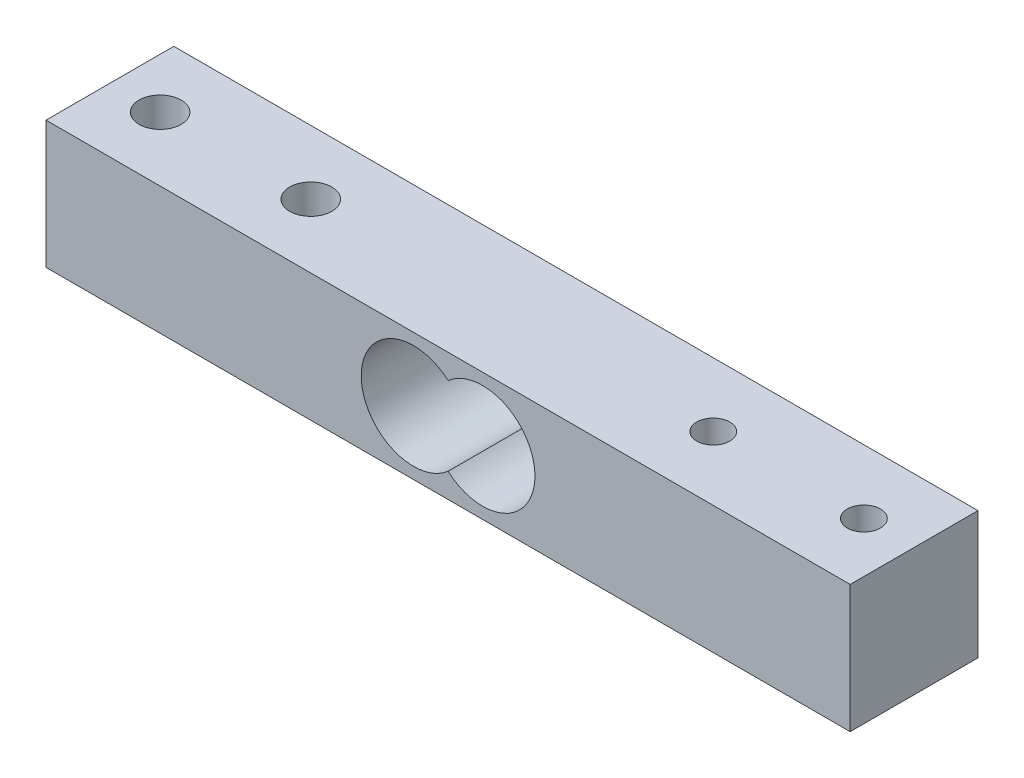
ISO-10303-21;
HEADER;
FILE_DESCRIPTION(('STEP AP214'),'2;1');
FILE_NAME('part.step','',(''),(''),'','','');
FILE_SCHEMA(('AUTOMOTIVE_DESIGN { 1 0 10303 214 1 1 1 1 }'));
ENDSEC;
DATA;
#1=APPLICATION_CONTEXT('core data for automotive mechanical design processes');
#2=APPLICATION_PROTOCOL_DEFINITION('international standard','automotive_design',2000,#1);
#3=PRODUCT_CONTEXT('',#1,'mechanical');
#4=PRODUCT('Part','Part','',(#3));
#5=PRODUCT_RELATED_PRODUCT_CATEGORY('part','',(#4));
#6=PRODUCT_DEFINITION_FORMATION('','',#4);
#7=PRODUCT_DEFINITION_CONTEXT('part definition',#1,'design');
#8=PRODUCT_DEFINITION('design','',#6,#7);
#9=PRODUCT_DEFINITION_SHAPE('','',#8);
#10=(LENGTH_UNIT() NAMED_UNIT(*) SI_UNIT(.MILLI.,.METRE.));
#11=(NAMED_UNIT(*) PLANE_ANGLE_UNIT() SI_UNIT($,.RADIAN.));
#12=(NAMED_UNIT(*) SI_UNIT($,.STERADIAN.) SOLID_ANGLE_UNIT());
#13=UNCERTAINTY_MEASURE_WITH_UNIT(LENGTH_MEASURE(1.E-05),#10,'distance_accuracy_value','');
#14=(GEOMETRIC_REPRESENTATION_CONTEXT(3) GLOBAL_UNCERTAINTY_ASSIGNED_CONTEXT((#13)) GLOBAL_UNIT_ASSIGNED_CONTEXT((#10,
#11,#12)) REPRESENTATION_CONTEXT('',''));
#15=CARTESIAN_POINT('',(0.,0.,0.));
#16=DIRECTION('',(0.,0.,1.));
#17=DIRECTION('',(1.,0.,0.));
#18=AXIS2_PLACEMENT_3D('',#15,#16,#17);
#19=CARTESIAN_POINT('',(-40.04,6.35,12.73));
#20=DIRECTION('',(1.,0.,0.));
#21=DIRECTION('',(0.,0.,-1.));
#22=AXIS2_PLACEMENT_3D('',#19,#20,#21);
#23=PLANE('',#22);
#24=DIRECTION('',(0.,-1.,0.));
#25=VECTOR('',#24,1.);
#26=CARTESIAN_POINT('',(-40.04,6.35,0.));
#27=LINE('',#26,#25);
#28=CARTESIAN_POINT('',(-40.04,6.35,0.));
#29=VERTEX_POINT('',#28);
#30=CARTESIAN_POINT('',(-40.04,-6.35,0.));
#31=VERTEX_POINT('',#30);
#32=EDGE_CURVE('E136',#29,#31,#27,.T.);
#33=ORIENTED_EDGE('',*,*,#32,.T.);
#34=DIRECTION('',(0.,0.,-1.));
#35=VECTOR('',#34,1.);
#36=CARTESIAN_POINT('',(-40.04,-6.35,12.73));
#37=LINE('',#36,#35);
#38=CARTESIAN_POINT('',(-40.04,-6.35,12.73));
#39=VERTEX_POINT('',#38);
#40=EDGE_CURVE('E11',#39,#31,#37,.T.);
#41=ORIENTED_EDGE('',*,*,#40,.F.);
#42=DIRECTION('',(0.,-1.,0.));
#43=VECTOR('',#42,1.);
#44=CARTESIAN_POINT('',(-40.04,6.35,12.73));
#45=LINE('',#44,#43);
#46=CARTESIAN_POINT('',(-40.04,6.35,12.73));
#47=VERTEX_POINT('',#46);
#48=EDGE_CURVE('E137',#47,#39,#45,.T.);
#49=ORIENTED_EDGE('',*,*,#48,.F.);
#50=DIRECTION('',(0.,0.,-1.));
#51=VECTOR('',#50,1.);
#52=CARTESIAN_POINT('',(-40.04,6.35,12.73));
#53=LINE('',#52,#51);
#54=EDGE_CURVE('E147',#47,#29,#53,.T.);
#55=ORIENTED_EDGE('',*,*,#54,.T.);
#56=EDGE_LOOP('',(#33,#41,#49,#55));
#57=FACE_BOUND('',#56,.T.);
#58=ADVANCED_FACE('F43',(#57),#23,.F.);
#59=CARTESIAN_POINT('',(40.04,-6.34999999999999,12.73));
#60=DIRECTION('',(0.,1.,0.));
#61=DIRECTION('',(-1.,0.,0.));
#62=AXIS2_PLACEMENT_3D('',#59,#60,#61);
#63=PLANE('',#62);
#64=CARTESIAN_POINT('',(20.04,-6.35000000000002,6.365));
#65=DIRECTION('',(0.,1.,0.));
#66=DIRECTION('',(0.,0.,1.));
#67=AXIS2_PLACEMENT_3D('',#64,#65,#66);
#68=CIRCLE('',#67,1.65);
#69=CARTESIAN_POINT('',(20.04,-6.35000000000002,8.01499999999999));
#70=VERTEX_POINT('',#69);
#71=EDGE_CURVE('E115',#70,#70,#68,.T.);
#72=ORIENTED_EDGE('',*,*,#71,.T.);
#73=EDGE_LOOP('',(#72));
#74=FACE_BOUND('',#73,.T.);
#75=CARTESIAN_POINT('',(35.04,-6.35000000000001,6.365));
#76=DIRECTION('',(0.,1.,0.));
#77=DIRECTION('',(0.,0.,1.));
#78=AXIS2_PLACEMENT_3D('',#75,#76,#77);
#79=CIRCLE('',#78,1.65);
#80=CARTESIAN_POINT('',(35.04,-6.35000000000001,8.015));
#81=VERTEX_POINT('',#80);
#82=EDGE_CURVE('E121',#81,#81,#79,.T.);
#83=ORIENTED_EDGE('',*,*,#82,.T.);
#84=EDGE_LOOP('',(#83));
#85=FACE_BOUND('',#84,.T.);
#86=CARTESIAN_POINT('',(-35.04,-6.35000000000001,6.365));
#87=DIRECTION('',(0.,1.,0.));
#88=DIRECTION('',(0.,0.,1.));
#89=AXIS2_PLACEMENT_3D('',#86,#87,#88);
#90=CIRCLE('',#89,2.1);
#91=CARTESIAN_POINT('',(-35.04,-6.35000000000001,8.465));
#92=VERTEX_POINT('',#91);
#93=EDGE_CURVE('E127',#92,#92,#90,.T.);
#94=ORIENTED_EDGE('',*,*,#93,.T.);
#95=EDGE_LOOP('',(#94));
#96=FACE_BOUND('',#95,.T.);
#97=CARTESIAN_POINT('',(-20.04,-6.35000000000001,6.365));
#98=DIRECTION('',(0.,1.,0.));
#99=DIRECTION('',(0.,0.,1.));
#100=AXIS2_PLACEMENT_3D('',#97,#98,#99);
#101=CIRCLE('',#100,2.1);
#102=CARTESIAN_POINT('',(-20.04,-6.35000000000001,8.46499999999999));
#103=VERTEX_POINT('',#102);
#104=EDGE_CURVE('E133',#103,#103,#101,.T.);
#105=ORIENTED_EDGE('',*,*,#104,.T.);
#106=EDGE_LOOP('',(#105));
#107=FACE_BOUND('',#106,.T.);
#108=DIRECTION('',(1.,0.,0.));
#109=VECTOR('',#108,1.);
#110=CARTESIAN_POINT('',(40.04,-6.34999999999999,0.));
#111=LINE('',#110,#109);
#112=CARTESIAN_POINT('',(40.04,-6.34999999999999,0.));
#113=VERTEX_POINT('',#112);
#114=EDGE_CURVE('E150',#31,#113,#111,.T.);
#115=ORIENTED_EDGE('',*,*,#114,.T.);
#116=DIRECTION('',(0.,0.,-1.));
#117=VECTOR('',#116,1.);
#118=CARTESIAN_POINT('',(40.04,-6.34999999999999,12.73));
#119=LINE('',#118,#117);
#120=CARTESIAN_POINT('',(40.04,-6.34999999999999,12.73));
#121=VERTEX_POINT('',#120);
#122=EDGE_CURVE('E50',#121,#113,#119,.T.);
#123=ORIENTED_EDGE('',*,*,#122,.F.);
#124=DIRECTION('',(1.,0.,0.));
#125=VECTOR('',#124,1.);
#126=CARTESIAN_POINT('',(40.04,-6.34999999999999,12.73));
#127=LINE('',#126,#125);
#128=EDGE_CURVE('E140',#39,#121,#127,.T.);
#129=ORIENTED_EDGE('',*,*,#128,.F.);
#130=ORIENTED_EDGE('',*,*,#40,.T.);
#131=EDGE_LOOP('',(#115,#123,#129,#130));
#132=FACE_BOUND('',#131,.T.);
#133=ADVANCED_FACE('F178',(#74,#85,#96,#107,#132),#63,.F.);
#134=CARTESIAN_POINT('',(40.04,6.35000000000001,12.73));
#135=DIRECTION('',(-1.,0.,0.));
#136=DIRECTION('',(0.,0.,1.));
#137=AXIS2_PLACEMENT_3D('',#134,#135,#136);
#138=PLANE('',#137);
#139=DIRECTION('',(0.,1.,0.));
#140=VECTOR('',#139,1.);
#141=CARTESIAN_POINT('',(40.04,6.35000000000001,0.));
#142=LINE('',#141,#140);
#143=CARTESIAN_POINT('',(40.04,6.35000000000001,0.));
#144=VERTEX_POINT('',#143);
#145=EDGE_CURVE('E152',#113,#144,#142,.T.);
#146=ORIENTED_EDGE('',*,*,#145,.T.);
#147=DIRECTION('',(0.,0.,-1.));
#148=VECTOR('',#147,1.);
#149=CARTESIAN_POINT('',(40.04,6.35000000000001,12.73));
#150=LINE('',#149,#148);
#151=CARTESIAN_POINT('',(40.04,6.35000000000001,12.73));
#152=VERTEX_POINT('',#151);
#153=EDGE_CURVE('E157',#152,#144,#150,.T.);
#154=ORIENTED_EDGE('',*,*,#153,.F.);
#155=DIRECTION('',(0.,1.,0.));
#156=VECTOR('',#155,1.);
#157=CARTESIAN_POINT('',(40.04,6.35000000000001,12.73));
#158=LINE('',#157,#156);
#159=EDGE_CURVE('E143',#121,#152,#158,.T.);
#160=ORIENTED_EDGE('',*,*,#159,.F.);
#161=ORIENTED_EDGE('',*,*,#122,.T.);
#162=EDGE_LOOP('',(#146,#154,#160,#161));
#163=FACE_BOUND('',#162,.T.);
#164=ADVANCED_FACE('F164',(#163),#138,.F.);
#165=CARTESIAN_POINT('',(40.04,6.35000000000001,12.73));
#166=DIRECTION('',(0.,-1.,0.));
#167=DIRECTION('',(1.,0.,0.));
#168=AXIS2_PLACEMENT_3D('',#165,#166,#167);
#169=PLANE('',#168);
#170=CARTESIAN_POINT('',(20.04,6.35,6.365));
#171=DIRECTION('',(0.,1.,0.));
#172=DIRECTION('',(0.,0.,1.));
#173=AXIS2_PLACEMENT_3D('',#170,#171,#172);
#174=CIRCLE('',#173,1.65);
#175=CARTESIAN_POINT('',(20.04,6.35,8.015));
#176=VERTEX_POINT('',#175);
#177=EDGE_CURVE('E111',#176,#176,#174,.T.);
#178=ORIENTED_EDGE('',*,*,#177,.F.);
#179=EDGE_LOOP('',(#178));
#180=FACE_BOUND('',#179,.T.);
#181=CARTESIAN_POINT('',(35.04,6.35000000000001,6.365));
#182=DIRECTION('',(0.,1.,0.));
#183=DIRECTION('',(0.,0.,1.));
#184=AXIS2_PLACEMENT_3D('',#181,#182,#183);
#185=CIRCLE('',#184,1.65);
#186=CARTESIAN_POINT('',(35.04,6.35000000000001,8.015));
#187=VERTEX_POINT('',#186);
#188=EDGE_CURVE('E118',#187,#187,#185,.T.);
#189=ORIENTED_EDGE('',*,*,#188,.F.);
#190=EDGE_LOOP('',(#189));
#191=FACE_BOUND('',#190,.T.);
#192=CARTESIAN_POINT('',(-35.04,6.35,6.365));
#193=DIRECTION('',(0.,1.,0.));
#194=DIRECTION('',(0.,0.,1.));
#195=AXIS2_PLACEMENT_3D('',#192,#193,#194);
#196=CIRCLE('',#195,2.1);
#197=CARTESIAN_POINT('',(-35.04,6.35,8.465));
#198=VERTEX_POINT('',#197);
#199=EDGE_CURVE('E124',#198,#198,#196,.T.);
#200=ORIENTED_EDGE('',*,*,#199,.F.);
#201=EDGE_LOOP('',(#200));
#202=FACE_BOUND('',#201,.T.);
#203=CARTESIAN_POINT('',(-20.04,6.35,6.365));
#204=DIRECTION('',(0.,1.,0.));
#205=DIRECTION('',(0.,0.,1.));
#206=AXIS2_PLACEMENT_3D('',#203,#204,#205);
#207=CIRCLE('',#206,2.1);
#208=CARTESIAN_POINT('',(-20.04,6.35,8.46499999999999));
#209=VERTEX_POINT('',#208);
#210=EDGE_CURVE('E130',#209,#209,#207,.T.);
#211=ORIENTED_EDGE('',*,*,#210,.F.);
#212=EDGE_LOOP('',(#211));
#213=FACE_BOUND('',#212,.T.);
#214=DIRECTION('',(-1.,0.,0.));
#215=VECTOR('',#214,1.);
#216=CARTESIAN_POINT('',(40.04,6.35000000000001,0.));
#217=LINE('',#216,#215);
#218=EDGE_CURVE('E141',#144,#29,#217,.T.);
#219=ORIENTED_EDGE('',*,*,#218,.T.);
#220=ORIENTED_EDGE('',*,*,#54,.F.);
#221=DIRECTION('',(-1.,0.,0.));
#222=VECTOR('',#221,1.);
#223=CARTESIAN_POINT('',(40.04,6.35000000000001,12.73));
#224=LINE('',#223,#222);
#225=EDGE_CURVE('E145',#152,#47,#224,.T.);
#226=ORIENTED_EDGE('',*,*,#225,.F.);
#227=ORIENTED_EDGE('',*,*,#153,.T.);
#228=EDGE_LOOP('',(#219,#220,#226,#227));
#229=FACE_BOUND('',#228,.T.);
#230=ADVANCED_FACE('F171',(#180,#191,#202,#213,#229),#169,.F.);
#231=CARTESIAN_POINT('',(0.,0.,12.73));
#232=DIRECTION('',(0.,0.,-1.));
#233=DIRECTION('',(-1.,0.,0.));
#234=AXIS2_PLACEMENT_3D('',#231,#232,#233);
#235=PLANE('',#234);
#236=CARTESIAN_POINT('',(3.44,0.,12.73));
#237=DIRECTION('',(0.,0.,1.));
#238=DIRECTION('',(1.,0.,0.));
#239=AXIS2_PLACEMENT_3D('',#236,#237,#238);
#240=CIRCLE('',#239,5.21);
#241=CARTESIAN_POINT('',(0.,-3.91286340165358,12.73));
#242=VERTEX_POINT('',#241);
#243=CARTESIAN_POINT('',(0.,3.91286340165358,12.73));
#244=VERTEX_POINT('',#243);
#245=EDGE_CURVE('E106',#242,#244,#240,.T.);
#246=ORIENTED_EDGE('',*,*,#245,.F.);
#247=CARTESIAN_POINT('',(-3.44,0.,12.73));
#248=DIRECTION('',(0.,0.,1.));
#249=DIRECTION('',(1.,0.,0.));
#250=AXIS2_PLACEMENT_3D('',#247,#248,#249);
#251=CIRCLE('',#250,5.21);
#252=EDGE_CURVE('E57',#244,#242,#251,.T.);
#253=ORIENTED_EDGE('',*,*,#252,.F.);
#254=EDGE_LOOP('',(#246,#253));
#255=FACE_BOUND('',#254,.T.);
#256=ORIENTED_EDGE('',*,*,#48,.T.);
#257=ORIENTED_EDGE('',*,*,#128,.T.);
#258=ORIENTED_EDGE('',*,*,#159,.T.);
#259=ORIENTED_EDGE('',*,*,#225,.T.);
#260=EDGE_LOOP('',(#256,#257,#258,#259));
#261=FACE_BOUND('',#260,.T.);
#262=ADVANCED_FACE('F177',(#255,#261),#235,.F.);
#263=CARTESIAN_POINT('',(0.,0.,0.));
#264=DIRECTION('',(0.,0.,-1.));
#265=DIRECTION('',(-1.,0.,0.));
#266=AXIS2_PLACEMENT_3D('',#263,#264,#265);
#267=PLANE('',#266);
#268=CARTESIAN_POINT('',(-3.44,0.,0.));
#269=DIRECTION('',(0.,0.,1.));
#270=DIRECTION('',(1.,0.,0.));
#271=AXIS2_PLACEMENT_3D('',#268,#269,#270);
#272=CIRCLE('',#271,5.21);
#273=CARTESIAN_POINT('',(0.,3.91286340165358,0.));
#274=VERTEX_POINT('',#273);
#275=CARTESIAN_POINT('',(0.,-3.91286340165358,0.));
#276=VERTEX_POINT('',#275);
#277=EDGE_CURVE('E62',#274,#276,#272,.T.);
#278=ORIENTED_EDGE('',*,*,#277,.T.);
#279=CARTESIAN_POINT('',(3.44,0.,0.));
#280=DIRECTION('',(0.,0.,1.));
#281=DIRECTION('',(1.,0.,0.));
#282=AXIS2_PLACEMENT_3D('',#279,#280,#281);
#283=CIRCLE('',#282,5.21);
#284=EDGE_CURVE('E98',#276,#274,#283,.T.);
#285=ORIENTED_EDGE('',*,*,#284,.T.);
#286=EDGE_LOOP('',(#278,#285));
#287=FACE_BOUND('',#286,.T.);
#288=ORIENTED_EDGE('',*,*,#32,.F.);
#289=ORIENTED_EDGE('',*,*,#218,.F.);
#290=ORIENTED_EDGE('',*,*,#145,.F.);
#291=ORIENTED_EDGE('',*,*,#114,.F.);
#292=EDGE_LOOP('',(#288,#289,#290,#291));
#293=FACE_BOUND('',#292,.T.);
#294=ADVANCED_FACE('F104',(#287,#293),#267,.T.);
#295=CARTESIAN_POINT('',(-20.04,6.35,6.365));
#296=DIRECTION('',(0.,1.,0.));
#297=DIRECTION('',(0.,0.,1.));
#298=AXIS2_PLACEMENT_3D('',#295,#296,#297);
#299=CYLINDRICAL_SURFACE('',#298,2.1);
#300=ORIENTED_EDGE('',*,*,#104,.F.);
#301=EDGE_LOOP('',(#300));
#302=FACE_BOUND('',#301,.T.);
#303=ORIENTED_EDGE('',*,*,#210,.T.);
#304=EDGE_LOOP('',(#303));
#305=FACE_BOUND('',#304,.T.);
#306=ADVANCED_FACE('F193',(#302,#305),#299,.F.);
#307=CARTESIAN_POINT('',(-35.04,6.35,6.365));
#308=DIRECTION('',(0.,1.,0.));
#309=DIRECTION('',(0.,0.,1.));
#310=AXIS2_PLACEMENT_3D('',#307,#308,#309);
#311=CYLINDRICAL_SURFACE('',#310,2.1);
#312=ORIENTED_EDGE('',*,*,#93,.F.);
#313=EDGE_LOOP('',(#312));
#314=FACE_BOUND('',#313,.T.);
#315=ORIENTED_EDGE('',*,*,#199,.T.);
#316=EDGE_LOOP('',(#315));
#317=FACE_BOUND('',#316,.T.);
#318=ADVANCED_FACE('F199',(#314,#317),#311,.F.);
#319=CARTESIAN_POINT('',(35.04,6.35000000000001,6.365));
#320=DIRECTION('',(0.,1.,0.));
#321=DIRECTION('',(0.,0.,1.));
#322=AXIS2_PLACEMENT_3D('',#319,#320,#321);
#323=CYLINDRICAL_SURFACE('',#322,1.65);
#324=ORIENTED_EDGE('',*,*,#82,.F.);
#325=EDGE_LOOP('',(#324));
#326=FACE_BOUND('',#325,.T.);
#327=ORIENTED_EDGE('',*,*,#188,.T.);
#328=EDGE_LOOP('',(#327));
#329=FACE_BOUND('',#328,.T.);
#330=ADVANCED_FACE('F203',(#326,#329),#323,.F.);
#331=CARTESIAN_POINT('',(20.04,6.35,6.365));
#332=DIRECTION('',(0.,1.,0.));
#333=DIRECTION('',(0.,0.,1.));
#334=AXIS2_PLACEMENT_3D('',#331,#332,#333);
#335=CYLINDRICAL_SURFACE('',#334,1.65);
#336=ORIENTED_EDGE('',*,*,#71,.F.);
#337=EDGE_LOOP('',(#336));
#338=FACE_BOUND('',#337,.T.);
#339=ORIENTED_EDGE('',*,*,#177,.T.);
#340=EDGE_LOOP('',(#339));
#341=FACE_BOUND('',#340,.T.);
#342=ADVANCED_FACE('F207',(#338,#341),#335,.F.);
#343=CARTESIAN_POINT('',(-3.44,0.,0.));
#344=DIRECTION('',(0.,0.,1.));
#345=DIRECTION('',(1.,0.,0.));
#346=AXIS2_PLACEMENT_3D('',#343,#344,#345);
#347=CYLINDRICAL_SURFACE('',#346,5.21);
#348=ORIENTED_EDGE('',*,*,#252,.T.);
#349=DIRECTION('',(0.,0.,1.));
#350=VECTOR('',#349,1.);
#351=CARTESIAN_POINT('',(0.,-3.91286340165358,0.));
#352=LINE('',#351,#350);
#353=EDGE_CURVE('E91',#276,#242,#352,.T.);
#354=ORIENTED_EDGE('',*,*,#353,.F.);
#355=ORIENTED_EDGE('',*,*,#277,.F.);
#356=DIRECTION('',(0.,0.,1.));
#357=VECTOR('',#356,1.);
#358=CARTESIAN_POINT('',(0.,3.91286340165358,0.));
#359=LINE('',#358,#357);
#360=EDGE_CURVE('E97',#274,#244,#359,.T.);
#361=ORIENTED_EDGE('',*,*,#360,.T.);
#362=EDGE_LOOP('',(#348,#354,#355,#361));
#363=FACE_BOUND('',#362,.T.);
#364=ADVANCED_FACE('F93',(#363),#347,.F.);
#365=CARTESIAN_POINT('',(3.44,0.,0.));
#366=DIRECTION('',(0.,0.,1.));
#367=DIRECTION('',(1.,0.,0.));
#368=AXIS2_PLACEMENT_3D('',#365,#366,#367);
#369=CYLINDRICAL_SURFACE('',#368,5.21);
#370=ORIENTED_EDGE('',*,*,#245,.T.);
#371=ORIENTED_EDGE('',*,*,#360,.F.);
#372=ORIENTED_EDGE('',*,*,#284,.F.);
#373=ORIENTED_EDGE('',*,*,#353,.T.);
#374=EDGE_LOOP('',(#370,#371,#372,#373));
#375=FACE_BOUND('',#374,.T.);
#376=ADVANCED_FACE('F101',(#375),#369,.F.);
#377=CLOSED_SHELL('',(#58,#133,#164,#230,#262,#294,#306,#318,#330,#342,#364,#376));
#378=MANIFOLD_SOLID_BREP('B2',#377);
#379=ADVANCED_BREP_SHAPE_REPRESENTATION('',(#18,#378),#14);
#380=SHAPE_DEFINITION_REPRESENTATION(#9,#379);
ENDSEC;
END-ISO-10303-21;
